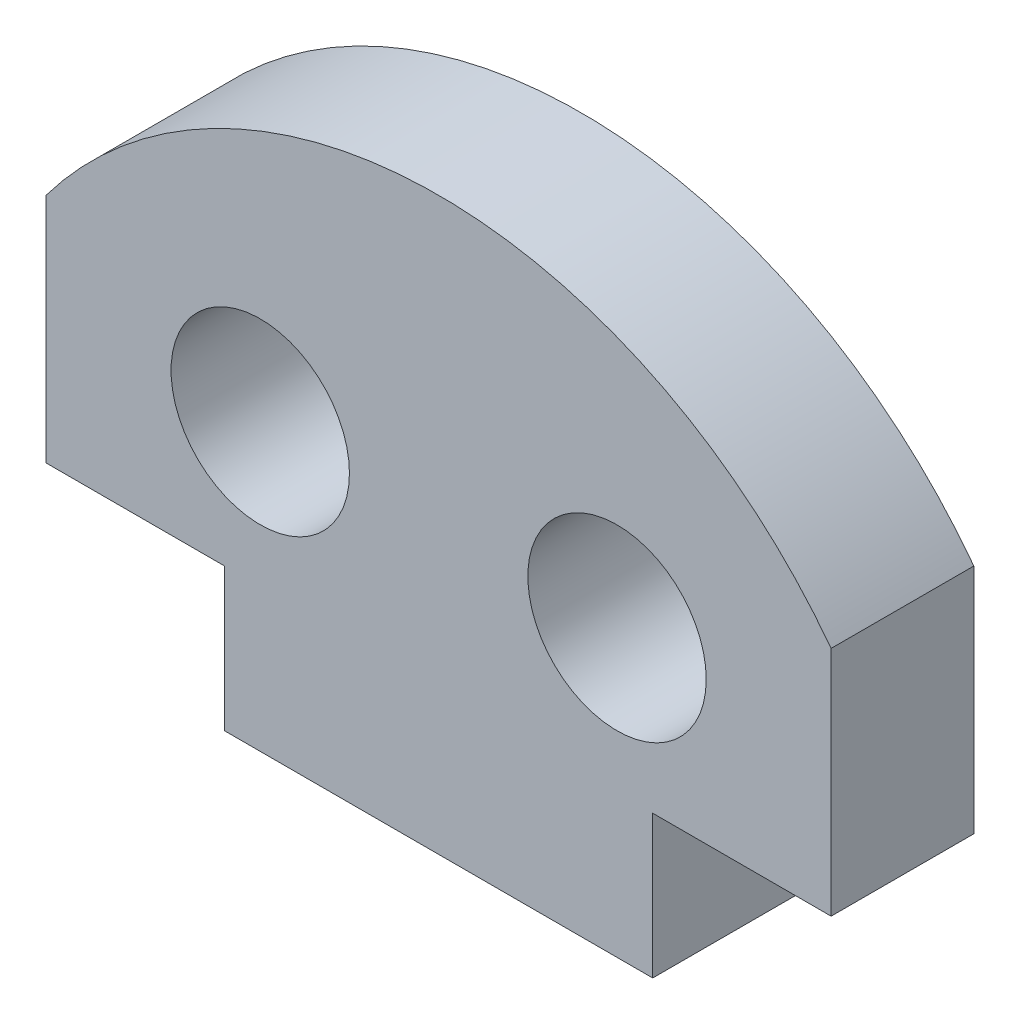
ISO-10303-21;
HEADER;
FILE_DESCRIPTION(('STEP AP214'),'2;1');
FILE_NAME('part.step','',(''),(''),'','','');
FILE_SCHEMA(('AUTOMOTIVE_DESIGN { 1 0 10303 214 1 1 1 1 }'));
ENDSEC;
DATA;
#1=APPLICATION_CONTEXT('core data for automotive mechanical design processes');
#2=APPLICATION_PROTOCOL_DEFINITION('international standard','automotive_design',2000,#1);
#3=PRODUCT_CONTEXT('',#1,'mechanical');
#4=PRODUCT('Part','Part','',(#3));
#5=PRODUCT_RELATED_PRODUCT_CATEGORY('part','',(#4));
#6=PRODUCT_DEFINITION_FORMATION('','',#4);
#7=PRODUCT_DEFINITION_CONTEXT('part definition',#1,'design');
#8=PRODUCT_DEFINITION('design','',#6,#7);
#9=PRODUCT_DEFINITION_SHAPE('','',#8);
#10=(LENGTH_UNIT() NAMED_UNIT(*) SI_UNIT(.MILLI.,.METRE.));
#11=(NAMED_UNIT(*) PLANE_ANGLE_UNIT() SI_UNIT($,.RADIAN.));
#12=(NAMED_UNIT(*) SI_UNIT($,.STERADIAN.) SOLID_ANGLE_UNIT());
#13=UNCERTAINTY_MEASURE_WITH_UNIT(LENGTH_MEASURE(1.E-05),#10,'distance_accuracy_value','');
#14=(GEOMETRIC_REPRESENTATION_CONTEXT(3) GLOBAL_UNCERTAINTY_ASSIGNED_CONTEXT((#13)) GLOBAL_UNIT_ASSIGNED_CONTEXT((#10,
#11,#12)) REPRESENTATION_CONTEXT('',''));
#15=CARTESIAN_POINT('',(0.,0.,0.));
#16=DIRECTION('',(0.,0.,1.));
#17=DIRECTION('',(1.,0.,0.));
#18=AXIS2_PLACEMENT_3D('',#15,#16,#17);
#19=CARTESIAN_POINT('',(1956.67680872112,1458.00911595094,2.));
#20=DIRECTION('',(0.,0.,1.));
#21=DIRECTION('',(1.,0.,0.));
#22=AXIS2_PLACEMENT_3D('',#19,#20,#21);
#23=PLANE('',#22);
#24=CARTESIAN_POINT('',(1959.17680872112,1460.88411595094,2.));
#25=DIRECTION('',(0.,0.,1.));
#26=DIRECTION('',(1.,0.,0.));
#27=AXIS2_PLACEMENT_3D('',#24,#25,#26);
#28=CIRCLE('',#27,1.24999999999997);
#29=CARTESIAN_POINT('',(1960.42680872112,1460.88411595094,2.));
#30=VERTEX_POINT('',#29);
#31=EDGE_CURVE('E133',#30,#30,#28,.T.);
#32=ORIENTED_EDGE('',*,*,#31,.F.);
#33=EDGE_LOOP('',(#32));
#34=FACE_BOUND('',#33,.T.);
#35=CARTESIAN_POINT('',(1956.67680872112,1458.00911595094,2.));
#36=DIRECTION('',(0.,0.,1.));
#37=DIRECTION('',(1.,0.,0.));
#38=AXIS2_PLACEMENT_3D('',#35,#36,#37);
#39=CIRCLE('',#38,6.87500000000529);
#40=CARTESIAN_POINT('',(1962.17680872112,1462.13411595095,2.));
#41=VERTEX_POINT('',#40);
#42=CARTESIAN_POINT('',(1951.17680872112,1462.13411595095,2.));
#43=VERTEX_POINT('',#42);
#44=EDGE_CURVE('E144',#41,#43,#39,.T.);
#45=ORIENTED_EDGE('',*,*,#44,.T.);
#46=DIRECTION('',(0.,-1.,0.));
#47=VECTOR('',#46,1.);
#48=CARTESIAN_POINT('',(1951.17680872112,1458.88411595094,2.));
#49=LINE('',#48,#47);
#50=CARTESIAN_POINT('',(1951.17680872112,1458.88411595094,2.));
#51=VERTEX_POINT('',#50);
#52=EDGE_CURVE('E92',#43,#51,#49,.T.);
#53=ORIENTED_EDGE('',*,*,#52,.T.);
#54=DIRECTION('',(1.,0.,0.));
#55=VECTOR('',#54,1.);
#56=CARTESIAN_POINT('',(1953.67680872112,1458.88411595094,2.));
#57=LINE('',#56,#55);
#58=CARTESIAN_POINT('',(1953.67680872112,1458.88411595094,2.));
#59=VERTEX_POINT('',#58);
#60=EDGE_CURVE('E159',#51,#59,#57,.T.);
#61=ORIENTED_EDGE('',*,*,#60,.T.);
#62=DIRECTION('',(0.,-1.,0.));
#63=VECTOR('',#62,1.);
#64=CARTESIAN_POINT('',(1953.67680872112,1458.88411595094,2.));
#65=LINE('',#64,#63);
#66=CARTESIAN_POINT('',(1953.67680872112,1456.88411595094,2.));
#67=VERTEX_POINT('',#66);
#68=EDGE_CURVE('E172',#59,#67,#65,.T.);
#69=ORIENTED_EDGE('',*,*,#68,.T.);
#70=DIRECTION('',(1.,0.,0.));
#71=VECTOR('',#70,1.);
#72=CARTESIAN_POINT('',(1953.67680872112,1456.88411595094,2.));
#73=LINE('',#72,#71);
#74=CARTESIAN_POINT('',(1959.67680872112,1456.88411595094,2.));
#75=VERTEX_POINT('',#74);
#76=EDGE_CURVE('E111',#67,#75,#73,.T.);
#77=ORIENTED_EDGE('',*,*,#76,.T.);
#78=DIRECTION('',(0.,1.,0.));
#79=VECTOR('',#78,1.);
#80=CARTESIAN_POINT('',(1959.67680872112,1456.88411595094,2.));
#81=LINE('',#80,#79);
#82=CARTESIAN_POINT('',(1959.67680872112,1458.88411595095,2.));
#83=VERTEX_POINT('',#82);
#84=EDGE_CURVE('E105',#75,#83,#81,.T.);
#85=ORIENTED_EDGE('',*,*,#84,.T.);
#86=DIRECTION('',(1.,0.,0.));
#87=VECTOR('',#86,1.);
#88=CARTESIAN_POINT('',(1962.17680872112,1458.88411595095,2.));
#89=LINE('',#88,#87);
#90=CARTESIAN_POINT('',(1962.17680872112,1458.88411595095,2.));
#91=VERTEX_POINT('',#90);
#92=EDGE_CURVE('E109',#83,#91,#89,.T.);
#93=ORIENTED_EDGE('',*,*,#92,.T.);
#94=DIRECTION('',(0.,1.,0.));
#95=VECTOR('',#94,1.);
#96=CARTESIAN_POINT('',(1962.17680872112,1458.88411595095,2.));
#97=LINE('',#96,#95);
#98=EDGE_CURVE('E49',#91,#41,#97,.T.);
#99=ORIENTED_EDGE('',*,*,#98,.T.);
#100=EDGE_LOOP('',(#45,#53,#61,#69,#77,#85,#93,#99));
#101=FACE_BOUND('',#100,.T.);
#102=CARTESIAN_POINT('',(1954.17680872112,1460.88411595095,2.));
#103=DIRECTION('',(0.,0.,1.));
#104=DIRECTION('',(1.,0.,0.));
#105=AXIS2_PLACEMENT_3D('',#102,#103,#104);
#106=CIRCLE('',#105,1.24999999999997);
#107=CARTESIAN_POINT('',(1955.42680872112,1460.88411595095,2.));
#108=VERTEX_POINT('',#107);
#109=EDGE_CURVE('E181',#108,#108,#106,.T.);
#110=ORIENTED_EDGE('',*,*,#109,.F.);
#111=EDGE_LOOP('',(#110));
#112=FACE_BOUND('',#111,.T.);
#113=ADVANCED_FACE('F32',(#34,#101,#112),#23,.T.);
#114=CARTESIAN_POINT('',(1956.67680872112,1458.00911595094,0.));
#115=DIRECTION('',(0.,0.,1.));
#116=DIRECTION('',(1.,0.,0.));
#117=AXIS2_PLACEMENT_3D('',#114,#115,#116);
#118=PLANE('',#117);
#119=CARTESIAN_POINT('',(1959.17680872112,1460.88411595094,0.));
#120=DIRECTION('',(0.,0.,1.));
#121=DIRECTION('',(1.,0.,0.));
#122=AXIS2_PLACEMENT_3D('',#119,#120,#121);
#123=CIRCLE('',#122,1.24999999999997);
#124=CARTESIAN_POINT('',(1960.42680872112,1460.88411595094,0.));
#125=VERTEX_POINT('',#124);
#126=EDGE_CURVE('E178',#125,#125,#123,.T.);
#127=ORIENTED_EDGE('',*,*,#126,.T.);
#128=EDGE_LOOP('',(#127));
#129=FACE_BOUND('',#128,.T.);
#130=CARTESIAN_POINT('',(1956.67680872112,1458.00911595094,0.));
#131=DIRECTION('',(0.,0.,1.));
#132=DIRECTION('',(1.,0.,0.));
#133=AXIS2_PLACEMENT_3D('',#130,#131,#132);
#134=CIRCLE('',#133,6.87500000000529);
#135=CARTESIAN_POINT('',(1962.17680872112,1462.13411595095,0.));
#136=VERTEX_POINT('',#135);
#137=CARTESIAN_POINT('',(1951.17680872112,1462.13411595095,0.));
#138=VERTEX_POINT('',#137);
#139=EDGE_CURVE('E129',#136,#138,#134,.T.);
#140=ORIENTED_EDGE('',*,*,#139,.F.);
#141=DIRECTION('',(0.,1.,0.));
#142=VECTOR('',#141,1.);
#143=CARTESIAN_POINT('',(1962.17680872112,1458.88411595095,0.));
#144=LINE('',#143,#142);
#145=CARTESIAN_POINT('',(1962.17680872112,1458.88411595095,0.));
#146=VERTEX_POINT('',#145);
#147=EDGE_CURVE('E84',#146,#136,#144,.T.);
#148=ORIENTED_EDGE('',*,*,#147,.F.);
#149=DIRECTION('',(1.,0.,0.));
#150=VECTOR('',#149,1.);
#151=CARTESIAN_POINT('',(1962.17680872112,1458.88411595095,0.));
#152=LINE('',#151,#150);
#153=CARTESIAN_POINT('',(1959.67680872112,1458.88411595095,0.));
#154=VERTEX_POINT('',#153);
#155=EDGE_CURVE('E78',#154,#146,#152,.T.);
#156=ORIENTED_EDGE('',*,*,#155,.F.);
#157=DIRECTION('',(0.,1.,0.));
#158=VECTOR('',#157,1.);
#159=CARTESIAN_POINT('',(1959.67680872112,1456.88411595094,0.));
#160=LINE('',#159,#158);
#161=CARTESIAN_POINT('',(1959.67680872112,1456.88411595094,0.));
#162=VERTEX_POINT('',#161);
#163=EDGE_CURVE('E119',#162,#154,#160,.T.);
#164=ORIENTED_EDGE('',*,*,#163,.F.);
#165=DIRECTION('',(1.,0.,0.));
#166=VECTOR('',#165,1.);
#167=CARTESIAN_POINT('',(1953.67680872112,1456.88411595094,0.));
#168=LINE('',#167,#166);
#169=CARTESIAN_POINT('',(1953.67680872112,1456.88411595094,0.));
#170=VERTEX_POINT('',#169);
#171=EDGE_CURVE('E139',#170,#162,#168,.T.);
#172=ORIENTED_EDGE('',*,*,#171,.F.);
#173=DIRECTION('',(0.,-1.,0.));
#174=VECTOR('',#173,1.);
#175=CARTESIAN_POINT('',(1953.67680872112,1458.88411595094,0.));
#176=LINE('',#175,#174);
#177=CARTESIAN_POINT('',(1953.67680872112,1458.88411595094,0.));
#178=VERTEX_POINT('',#177);
#179=EDGE_CURVE('E137',#178,#170,#176,.T.);
#180=ORIENTED_EDGE('',*,*,#179,.F.);
#181=DIRECTION('',(1.,0.,0.));
#182=VECTOR('',#181,1.);
#183=CARTESIAN_POINT('',(1953.67680872112,1458.88411595094,0.));
#184=LINE('',#183,#182);
#185=CARTESIAN_POINT('',(1951.17680872112,1458.88411595094,0.));
#186=VERTEX_POINT('',#185);
#187=EDGE_CURVE('E135',#186,#178,#184,.T.);
#188=ORIENTED_EDGE('',*,*,#187,.F.);
#189=DIRECTION('',(0.,-1.,0.));
#190=VECTOR('',#189,1.);
#191=CARTESIAN_POINT('',(1951.17680872112,1458.88411595094,0.));
#192=LINE('',#191,#190);
#193=EDGE_CURVE('E132',#138,#186,#192,.T.);
#194=ORIENTED_EDGE('',*,*,#193,.F.);
#195=EDGE_LOOP('',(#140,#148,#156,#164,#172,#180,#188,#194));
#196=FACE_BOUND('',#195,.T.);
#197=CARTESIAN_POINT('',(1954.17680872112,1460.88411595095,0.));
#198=DIRECTION('',(0.,0.,1.));
#199=DIRECTION('',(1.,0.,0.));
#200=AXIS2_PLACEMENT_3D('',#197,#198,#199);
#201=CIRCLE('',#200,1.24999999999997);
#202=CARTESIAN_POINT('',(1955.42680872112,1460.88411595095,0.));
#203=VERTEX_POINT('',#202);
#204=EDGE_CURVE('E184',#203,#203,#201,.T.);
#205=ORIENTED_EDGE('',*,*,#204,.T.);
#206=EDGE_LOOP('',(#205));
#207=FACE_BOUND('',#206,.T.);
#208=ADVANCED_FACE('F163',(#129,#196,#207),#118,.F.);
#209=CARTESIAN_POINT('',(1956.67680872112,1458.00911595094,2.));
#210=DIRECTION('',(0.,0.,-1.));
#211=DIRECTION('',(-1.,0.,0.));
#212=AXIS2_PLACEMENT_3D('',#209,#210,#211);
#213=CYLINDRICAL_SURFACE('',#212,6.87500000000529);
#214=ORIENTED_EDGE('',*,*,#139,.T.);
#215=DIRECTION('',(0.,0.,-1.));
#216=VECTOR('',#215,1.);
#217=CARTESIAN_POINT('',(1951.17680872112,1462.13411595095,2.));
#218=LINE('',#217,#216);
#219=EDGE_CURVE('E11',#43,#138,#218,.T.);
#220=ORIENTED_EDGE('',*,*,#219,.F.);
#221=ORIENTED_EDGE('',*,*,#44,.F.);
#222=DIRECTION('',(0.,0.,-1.));
#223=VECTOR('',#222,1.);
#224=CARTESIAN_POINT('',(1962.17680872112,1462.13411595095,2.));
#225=LINE('',#224,#223);
#226=EDGE_CURVE('E125',#41,#136,#225,.T.);
#227=ORIENTED_EDGE('',*,*,#226,.T.);
#228=EDGE_LOOP('',(#214,#220,#221,#227));
#229=FACE_BOUND('',#228,.T.);
#230=ADVANCED_FACE('F34',(#229),#213,.T.);
#231=CARTESIAN_POINT('',(1951.17680872112,1458.88411595094,2.));
#232=DIRECTION('',(1.,0.,0.));
#233=DIRECTION('',(0.,0.,-1.));
#234=AXIS2_PLACEMENT_3D('',#231,#232,#233);
#235=PLANE('',#234);
#236=ORIENTED_EDGE('',*,*,#193,.T.);
#237=DIRECTION('',(0.,0.,-1.));
#238=VECTOR('',#237,1.);
#239=CARTESIAN_POINT('',(1951.17680872112,1458.88411595094,2.));
#240=LINE('',#239,#238);
#241=EDGE_CURVE('E41',#51,#186,#240,.T.);
#242=ORIENTED_EDGE('',*,*,#241,.F.);
#243=ORIENTED_EDGE('',*,*,#52,.F.);
#244=ORIENTED_EDGE('',*,*,#219,.T.);
#245=EDGE_LOOP('',(#236,#242,#243,#244));
#246=FACE_BOUND('',#245,.T.);
#247=ADVANCED_FACE('F217',(#246),#235,.F.);
#248=CARTESIAN_POINT('',(1953.67680872112,1458.88411595094,2.));
#249=DIRECTION('',(0.,1.,0.));
#250=DIRECTION('',(0.,0.,1.));
#251=AXIS2_PLACEMENT_3D('',#248,#249,#250);
#252=PLANE('',#251);
#253=ORIENTED_EDGE('',*,*,#187,.T.);
#254=DIRECTION('',(0.,0.,-1.));
#255=VECTOR('',#254,1.);
#256=CARTESIAN_POINT('',(1953.67680872112,1458.88411595094,2.));
#257=LINE('',#256,#255);
#258=EDGE_CURVE('E151',#59,#178,#257,.T.);
#259=ORIENTED_EDGE('',*,*,#258,.F.);
#260=ORIENTED_EDGE('',*,*,#60,.F.);
#261=ORIENTED_EDGE('',*,*,#241,.T.);
#262=EDGE_LOOP('',(#253,#259,#260,#261));
#263=FACE_BOUND('',#262,.T.);
#264=ADVANCED_FACE('F157',(#263),#252,.F.);
#265=CARTESIAN_POINT('',(1953.67680872112,1458.88411595094,2.));
#266=DIRECTION('',(1.,0.,0.));
#267=DIRECTION('',(0.,0.,-1.));
#268=AXIS2_PLACEMENT_3D('',#265,#266,#267);
#269=PLANE('',#268);
#270=ORIENTED_EDGE('',*,*,#179,.T.);
#271=DIRECTION('',(0.,0.,-1.));
#272=VECTOR('',#271,1.);
#273=CARTESIAN_POINT('',(1953.67680872112,1456.88411595094,2.));
#274=LINE('',#273,#272);
#275=EDGE_CURVE('E148',#67,#170,#274,.T.);
#276=ORIENTED_EDGE('',*,*,#275,.F.);
#277=ORIENTED_EDGE('',*,*,#68,.F.);
#278=ORIENTED_EDGE('',*,*,#258,.T.);
#279=EDGE_LOOP('',(#270,#276,#277,#278));
#280=FACE_BOUND('',#279,.T.);
#281=ADVANCED_FACE('F168',(#280),#269,.F.);
#282=CARTESIAN_POINT('',(1953.67680872112,1456.88411595094,2.));
#283=DIRECTION('',(0.,1.,0.));
#284=DIRECTION('',(0.,0.,1.));
#285=AXIS2_PLACEMENT_3D('',#282,#283,#284);
#286=PLANE('',#285);
#287=ORIENTED_EDGE('',*,*,#171,.T.);
#288=DIRECTION('',(0.,0.,-1.));
#289=VECTOR('',#288,1.);
#290=CARTESIAN_POINT('',(1959.67680872112,1456.88411595094,2.));
#291=LINE('',#290,#289);
#292=EDGE_CURVE('E120',#75,#162,#291,.T.);
#293=ORIENTED_EDGE('',*,*,#292,.F.);
#294=ORIENTED_EDGE('',*,*,#76,.F.);
#295=ORIENTED_EDGE('',*,*,#275,.T.);
#296=EDGE_LOOP('',(#287,#293,#294,#295));
#297=FACE_BOUND('',#296,.T.);
#298=ADVANCED_FACE('F171',(#297),#286,.F.);
#299=CARTESIAN_POINT('',(1959.67680872112,1456.88411595094,2.));
#300=DIRECTION('',(-1.,0.,0.));
#301=DIRECTION('',(0.,0.,1.));
#302=AXIS2_PLACEMENT_3D('',#299,#300,#301);
#303=PLANE('',#302);
#304=ORIENTED_EDGE('',*,*,#163,.T.);
#305=DIRECTION('',(0.,0.,-1.));
#306=VECTOR('',#305,1.);
#307=CARTESIAN_POINT('',(1959.67680872112,1458.88411595095,2.));
#308=LINE('',#307,#306);
#309=EDGE_CURVE('E116',#83,#154,#308,.T.);
#310=ORIENTED_EDGE('',*,*,#309,.F.);
#311=ORIENTED_EDGE('',*,*,#84,.F.);
#312=ORIENTED_EDGE('',*,*,#292,.T.);
#313=EDGE_LOOP('',(#304,#310,#311,#312));
#314=FACE_BOUND('',#313,.T.);
#315=ADVANCED_FACE('F117',(#314),#303,.F.);
#316=CARTESIAN_POINT('',(1962.17680872112,1458.88411595095,2.));
#317=DIRECTION('',(0.,1.,0.));
#318=DIRECTION('',(0.,0.,1.));
#319=AXIS2_PLACEMENT_3D('',#316,#317,#318);
#320=PLANE('',#319);
#321=ORIENTED_EDGE('',*,*,#155,.T.);
#322=DIRECTION('',(0.,0.,-1.));
#323=VECTOR('',#322,1.);
#324=CARTESIAN_POINT('',(1962.17680872112,1458.88411595095,2.));
#325=LINE('',#324,#323);
#326=EDGE_CURVE('E121',#91,#146,#325,.T.);
#327=ORIENTED_EDGE('',*,*,#326,.F.);
#328=ORIENTED_EDGE('',*,*,#92,.F.);
#329=ORIENTED_EDGE('',*,*,#309,.T.);
#330=EDGE_LOOP('',(#321,#327,#328,#329));
#331=FACE_BOUND('',#330,.T.);
#332=ADVANCED_FACE('F123',(#331),#320,.F.);
#333=CARTESIAN_POINT('',(1962.17680872112,1458.88411595095,2.));
#334=DIRECTION('',(-1.,0.,0.));
#335=DIRECTION('',(0.,0.,1.));
#336=AXIS2_PLACEMENT_3D('',#333,#334,#335);
#337=PLANE('',#336);
#338=ORIENTED_EDGE('',*,*,#147,.T.);
#339=ORIENTED_EDGE('',*,*,#226,.F.);
#340=ORIENTED_EDGE('',*,*,#98,.F.);
#341=ORIENTED_EDGE('',*,*,#326,.T.);
#342=EDGE_LOOP('',(#338,#339,#340,#341));
#343=FACE_BOUND('',#342,.T.);
#344=ADVANCED_FACE('F205',(#343),#337,.F.);
#345=CARTESIAN_POINT('',(1959.17680872112,1460.88411595094,2.));
#346=DIRECTION('',(0.,0.,-1.));
#347=DIRECTION('',(-1.,0.,0.));
#348=AXIS2_PLACEMENT_3D('',#345,#346,#347);
#349=CYLINDRICAL_SURFACE('',#348,1.24999999999997);
#350=ORIENTED_EDGE('',*,*,#31,.T.);
#351=EDGE_LOOP('',(#350));
#352=FACE_BOUND('',#351,.T.);
#353=ORIENTED_EDGE('',*,*,#126,.F.);
#354=EDGE_LOOP('',(#353));
#355=FACE_BOUND('',#354,.T.);
#356=ADVANCED_FACE('F202',(#352,#355),#349,.F.);
#357=CARTESIAN_POINT('',(1954.17680872112,1460.88411595095,2.));
#358=DIRECTION('',(0.,0.,-1.));
#359=DIRECTION('',(-1.,0.,0.));
#360=AXIS2_PLACEMENT_3D('',#357,#358,#359);
#361=CYLINDRICAL_SURFACE('',#360,1.24999999999997);
#362=ORIENTED_EDGE('',*,*,#109,.T.);
#363=EDGE_LOOP('',(#362));
#364=FACE_BOUND('',#363,.T.);
#365=ORIENTED_EDGE('',*,*,#204,.F.);
#366=EDGE_LOOP('',(#365));
#367=FACE_BOUND('',#366,.T.);
#368=ADVANCED_FACE('F190',(#364,#367),#361,.F.);
#369=CLOSED_SHELL('',(#113,#208,#230,#247,#264,#281,#298,#315,#332,#344,#356,#368));
#370=MANIFOLD_SOLID_BREP('B2',#369);
#371=ADVANCED_BREP_SHAPE_REPRESENTATION('',(#18,#370),#14);
#372=SHAPE_DEFINITION_REPRESENTATION(#9,#371);
ENDSEC;
END-ISO-10303-21;
